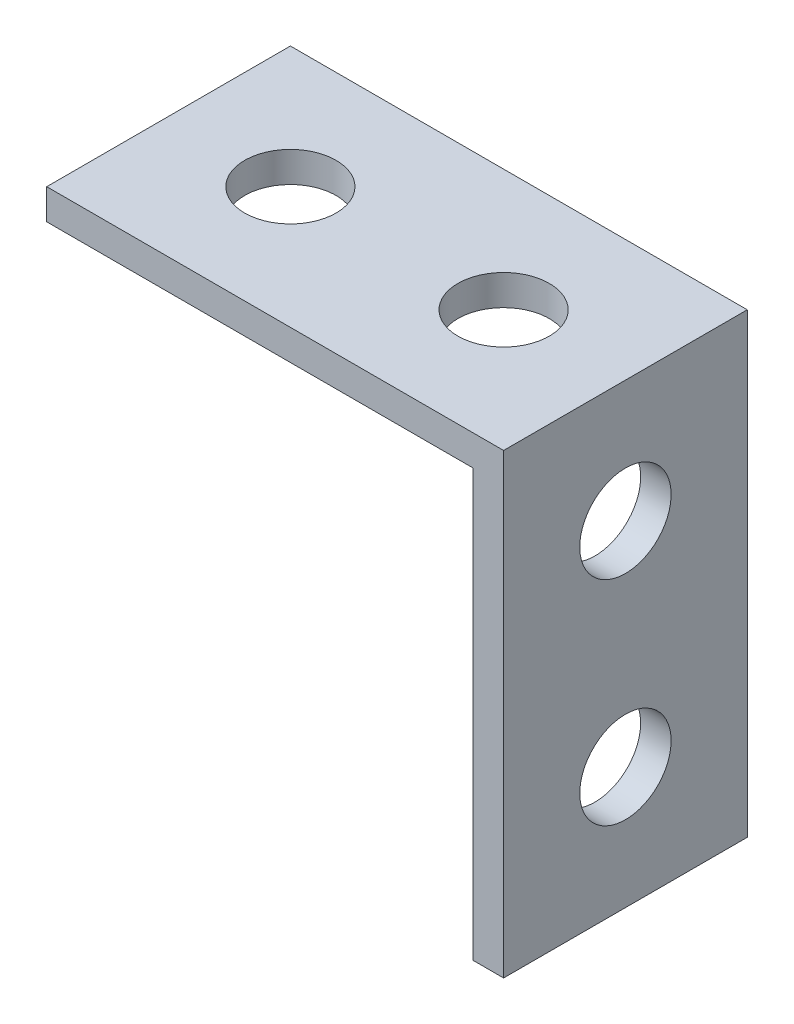
ISO-10303-21;
HEADER;
FILE_DESCRIPTION(('STEP AP214'),'2;1');
FILE_NAME('part.step','',(''),(''),'','','');
FILE_SCHEMA(('AUTOMOTIVE_DESIGN { 1 0 10303 214 1 1 1 1 }'));
ENDSEC;
DATA;
#1=APPLICATION_CONTEXT('core data for automotive mechanical design processes');
#2=APPLICATION_PROTOCOL_DEFINITION('international standard','automotive_design',2000,#1);
#3=PRODUCT_CONTEXT('',#1,'mechanical');
#4=PRODUCT('Part','Part','',(#3));
#5=PRODUCT_RELATED_PRODUCT_CATEGORY('part','',(#4));
#6=PRODUCT_DEFINITION_FORMATION('','',#4);
#7=PRODUCT_DEFINITION_CONTEXT('part definition',#1,'design');
#8=PRODUCT_DEFINITION('design','',#6,#7);
#9=PRODUCT_DEFINITION_SHAPE('','',#8);
#10=(LENGTH_UNIT() NAMED_UNIT(*) SI_UNIT(.MILLI.,.METRE.));
#11=(NAMED_UNIT(*) PLANE_ANGLE_UNIT() SI_UNIT($,.RADIAN.));
#12=(NAMED_UNIT(*) SI_UNIT($,.STERADIAN.) SOLID_ANGLE_UNIT());
#13=UNCERTAINTY_MEASURE_WITH_UNIT(LENGTH_MEASURE(1.E-05),#10,'distance_accuracy_value','');
#14=(GEOMETRIC_REPRESENTATION_CONTEXT(3) GLOBAL_UNCERTAINTY_ASSIGNED_CONTEXT((#13)) GLOBAL_UNIT_ASSIGNED_CONTEXT((#10,
#11,#12)) REPRESENTATION_CONTEXT('',''));
#15=CARTESIAN_POINT('',(0.,0.,0.));
#16=DIRECTION('',(0.,0.,1.));
#17=DIRECTION('',(1.,0.,0.));
#18=AXIS2_PLACEMENT_3D('',#15,#16,#17);
#19=CARTESIAN_POINT('',(7.5,0.,8.));
#20=DIRECTION('',(1.,0.,0.));
#21=DIRECTION('',(0.,1.,0.));
#22=AXIS2_PLACEMENT_3D('',#19,#20,#21);
#23=PLANE('',#22);
#24=CARTESIAN_POINT('',(7.5,-3.5,4.));
#25=DIRECTION('',(1.,0.,0.));
#26=DIRECTION('',(0.,1.,0.));
#27=AXIS2_PLACEMENT_3D('',#24,#25,#26);
#28=CIRCLE('',#27,1.5);
#29=CARTESIAN_POINT('',(7.5,-2.,4.));
#30=VERTEX_POINT('',#29);
#31=EDGE_CURVE('E169',#30,#30,#28,.T.);
#32=ORIENTED_EDGE('',*,*,#31,.F.);
#33=EDGE_LOOP('',(#32));
#34=FACE_BOUND('',#33,.T.);
#35=CARTESIAN_POINT('',(7.50000000000001,-10.5,4.));
#36=DIRECTION('',(1.,0.,0.));
#37=DIRECTION('',(0.,1.,0.));
#38=AXIS2_PLACEMENT_3D('',#35,#36,#37);
#39=CIRCLE('',#38,1.5);
#40=CARTESIAN_POINT('',(7.50000000000001,-9.,4.));
#41=VERTEX_POINT('',#40);
#42=EDGE_CURVE('E177',#41,#41,#39,.T.);
#43=ORIENTED_EDGE('',*,*,#42,.F.);
#44=EDGE_LOOP('',(#43));
#45=FACE_BOUND('',#44,.T.);
#46=DIRECTION('',(0.,-1.,0.));
#47=VECTOR('',#46,1.);
#48=CARTESIAN_POINT('',(7.5,0.,0.));
#49=LINE('',#48,#47);
#50=CARTESIAN_POINT('',(7.5,0.5,0.));
#51=VERTEX_POINT('',#50);
#52=CARTESIAN_POINT('',(7.5,-14.5,0.));
#53=VERTEX_POINT('',#52);
#54=EDGE_CURVE('E130',#51,#53,#49,.T.);
#55=ORIENTED_EDGE('',*,*,#54,.F.);
#56=DIRECTION('',(0.,0.,-1.));
#57=VECTOR('',#56,1.);
#58=CARTESIAN_POINT('',(7.5,0.5,8.));
#59=LINE('',#58,#57);
#60=CARTESIAN_POINT('',(7.5,0.5,8.));
#61=VERTEX_POINT('',#60);
#62=EDGE_CURVE('E11',#61,#51,#59,.T.);
#63=ORIENTED_EDGE('',*,*,#62,.F.);
#64=DIRECTION('',(0.,-1.,0.));
#65=VECTOR('',#64,1.);
#66=CARTESIAN_POINT('',(7.5,0.,8.));
#67=LINE('',#66,#65);
#68=CARTESIAN_POINT('',(7.5,-14.5,8.));
#69=VERTEX_POINT('',#68);
#70=EDGE_CURVE('E150',#61,#69,#67,.T.);
#71=ORIENTED_EDGE('',*,*,#70,.T.);
#72=DIRECTION('',(0.,0.,-1.));
#73=VECTOR('',#72,1.);
#74=CARTESIAN_POINT('',(7.5,-14.5,8.));
#75=LINE('',#74,#73);
#76=EDGE_CURVE('E60',#69,#53,#75,.T.);
#77=ORIENTED_EDGE('',*,*,#76,.T.);
#78=EDGE_LOOP('',(#55,#63,#71,#77));
#79=FACE_BOUND('',#78,.T.);
#80=ADVANCED_FACE('F41',(#34,#45,#79),#23,.T.);
#81=CARTESIAN_POINT('',(0.,0.5,8.));
#82=DIRECTION('',(0.,1.,0.));
#83=DIRECTION('',(0.,0.,1.));
#84=AXIS2_PLACEMENT_3D('',#81,#82,#83);
#85=PLANE('',#84);
#86=CARTESIAN_POINT('',(-3.5,0.5,4.));
#87=DIRECTION('',(0.,1.,0.));
#88=DIRECTION('',(0.,0.,1.));
#89=AXIS2_PLACEMENT_3D('',#86,#87,#88);
#90=CIRCLE('',#89,1.5);
#91=CARTESIAN_POINT('',(-3.5,0.5,5.5));
#92=VERTEX_POINT('',#91);
#93=EDGE_CURVE('E163',#92,#92,#90,.T.);
#94=ORIENTED_EDGE('',*,*,#93,.F.);
#95=EDGE_LOOP('',(#94));
#96=FACE_BOUND('',#95,.T.);
#97=CARTESIAN_POINT('',(3.5,0.5,4.));
#98=DIRECTION('',(0.,1.,0.));
#99=DIRECTION('',(0.,0.,1.));
#100=AXIS2_PLACEMENT_3D('',#97,#98,#99);
#101=CIRCLE('',#100,1.5);
#102=CARTESIAN_POINT('',(3.5,0.5,5.5));
#103=VERTEX_POINT('',#102);
#104=EDGE_CURVE('E175',#103,#103,#101,.T.);
#105=ORIENTED_EDGE('',*,*,#104,.F.);
#106=EDGE_LOOP('',(#105));
#107=FACE_BOUND('',#106,.T.);
#108=DIRECTION('',(1.,0.,0.));
#109=VECTOR('',#108,1.);
#110=CARTESIAN_POINT('',(0.,0.5,0.));
#111=LINE('',#110,#109);
#112=CARTESIAN_POINT('',(-7.5,0.5,0.));
#113=VERTEX_POINT('',#112);
#114=EDGE_CURVE('E133',#113,#51,#111,.T.);
#115=ORIENTED_EDGE('',*,*,#114,.F.);
#116=DIRECTION('',(0.,0.,-1.));
#117=VECTOR('',#116,1.);
#118=CARTESIAN_POINT('',(-7.5,0.5,8.));
#119=LINE('',#118,#117);
#120=CARTESIAN_POINT('',(-7.5,0.5,8.));
#121=VERTEX_POINT('',#120);
#122=EDGE_CURVE('E51',#121,#113,#119,.T.);
#123=ORIENTED_EDGE('',*,*,#122,.F.);
#124=DIRECTION('',(1.,0.,0.));
#125=VECTOR('',#124,1.);
#126=CARTESIAN_POINT('',(0.,0.5,8.));
#127=LINE('',#126,#125);
#128=EDGE_CURVE('E193',#121,#61,#127,.T.);
#129=ORIENTED_EDGE('',*,*,#128,.T.);
#130=ORIENTED_EDGE('',*,*,#62,.T.);
#131=EDGE_LOOP('',(#115,#123,#129,#130));
#132=FACE_BOUND('',#131,.T.);
#133=ADVANCED_FACE('F199',(#96,#107,#132),#85,.T.);
#134=CARTESIAN_POINT('',(-7.5,0.,8.));
#135=DIRECTION('',(1.,0.,0.));
#136=DIRECTION('',(0.,1.,0.));
#137=AXIS2_PLACEMENT_3D('',#134,#135,#136);
#138=PLANE('',#137);
#139=DIRECTION('',(0.,-1.,0.));
#140=VECTOR('',#139,1.);
#141=CARTESIAN_POINT('',(-7.5,0.,0.));
#142=LINE('',#141,#140);
#143=CARTESIAN_POINT('',(-7.5,-0.5,0.));
#144=VERTEX_POINT('',#143);
#145=EDGE_CURVE('E138',#113,#144,#142,.T.);
#146=ORIENTED_EDGE('',*,*,#145,.T.);
#147=DIRECTION('',(0.,0.,-1.));
#148=VECTOR('',#147,1.);
#149=CARTESIAN_POINT('',(-7.5,-0.5,8.));
#150=LINE('',#149,#148);
#151=CARTESIAN_POINT('',(-7.5,-0.5,8.));
#152=VERTEX_POINT('',#151);
#153=EDGE_CURVE('E120',#152,#144,#150,.T.);
#154=ORIENTED_EDGE('',*,*,#153,.F.);
#155=DIRECTION('',(0.,-1.,0.));
#156=VECTOR('',#155,1.);
#157=CARTESIAN_POINT('',(-7.5,0.,8.));
#158=LINE('',#157,#156);
#159=EDGE_CURVE('E106',#121,#152,#158,.T.);
#160=ORIENTED_EDGE('',*,*,#159,.F.);
#161=ORIENTED_EDGE('',*,*,#122,.T.);
#162=EDGE_LOOP('',(#146,#154,#160,#161));
#163=FACE_BOUND('',#162,.T.);
#164=ADVANCED_FACE('F205',(#163),#138,.F.);
#165=CARTESIAN_POINT('',(0.,-0.5,8.));
#166=DIRECTION('',(0.,1.,0.));
#167=DIRECTION('',(0.,0.,1.));
#168=AXIS2_PLACEMENT_3D('',#165,#166,#167);
#169=PLANE('',#168);
#170=CARTESIAN_POINT('',(-3.5,-0.5,4.));
#171=DIRECTION('',(0.,1.,0.));
#172=DIRECTION('',(0.,0.,1.));
#173=AXIS2_PLACEMENT_3D('',#170,#171,#172);
#174=CIRCLE('',#173,1.5);
#175=CARTESIAN_POINT('',(-3.5,-0.5,5.5));
#176=VERTEX_POINT('',#175);
#177=EDGE_CURVE('E134',#176,#176,#174,.T.);
#178=ORIENTED_EDGE('',*,*,#177,.T.);
#179=EDGE_LOOP('',(#178));
#180=FACE_BOUND('',#179,.T.);
#181=CARTESIAN_POINT('',(3.5,-0.5,4.));
#182=DIRECTION('',(0.,1.,0.));
#183=DIRECTION('',(0.,0.,1.));
#184=AXIS2_PLACEMENT_3D('',#181,#182,#183);
#185=CIRCLE('',#184,1.5);
#186=CARTESIAN_POINT('',(3.5,-0.5,5.5));
#187=VERTEX_POINT('',#186);
#188=EDGE_CURVE('E159',#187,#187,#185,.T.);
#189=ORIENTED_EDGE('',*,*,#188,.T.);
#190=EDGE_LOOP('',(#189));
#191=FACE_BOUND('',#190,.T.);
#192=DIRECTION('',(1.,0.,0.));
#193=VECTOR('',#192,1.);
#194=CARTESIAN_POINT('',(0.,-0.5,0.));
#195=LINE('',#194,#193);
#196=CARTESIAN_POINT('',(6.5,-0.5,0.));
#197=VERTEX_POINT('',#196);
#198=EDGE_CURVE('E116',#144,#197,#195,.T.);
#199=ORIENTED_EDGE('',*,*,#198,.T.);
#200=DIRECTION('',(0.,0.,-1.));
#201=VECTOR('',#200,1.);
#202=CARTESIAN_POINT('',(6.5,-0.5,8.));
#203=LINE('',#202,#201);
#204=CARTESIAN_POINT('',(6.5,-0.5,8.));
#205=VERTEX_POINT('',#204);
#206=EDGE_CURVE('E113',#205,#197,#203,.T.);
#207=ORIENTED_EDGE('',*,*,#206,.F.);
#208=DIRECTION('',(1.,0.,0.));
#209=VECTOR('',#208,1.);
#210=CARTESIAN_POINT('',(0.,-0.5,8.));
#211=LINE('',#210,#209);
#212=EDGE_CURVE('E98',#152,#205,#211,.T.);
#213=ORIENTED_EDGE('',*,*,#212,.F.);
#214=ORIENTED_EDGE('',*,*,#153,.T.);
#215=EDGE_LOOP('',(#199,#207,#213,#214));
#216=FACE_BOUND('',#215,.T.);
#217=ADVANCED_FACE('F114',(#180,#191,#216),#169,.F.);
#218=CARTESIAN_POINT('',(6.5,0.,8.));
#219=DIRECTION('',(1.,0.,0.));
#220=DIRECTION('',(0.,1.,0.));
#221=AXIS2_PLACEMENT_3D('',#218,#219,#220);
#222=PLANE('',#221);
#223=CARTESIAN_POINT('',(6.5,-3.5,4.));
#224=DIRECTION('',(1.,0.,0.));
#225=DIRECTION('',(0.,1.,0.));
#226=AXIS2_PLACEMENT_3D('',#223,#224,#225);
#227=CIRCLE('',#226,1.5);
#228=CARTESIAN_POINT('',(6.5,-2.,4.));
#229=VERTEX_POINT('',#228);
#230=EDGE_CURVE('E44',#229,#229,#227,.T.);
#231=ORIENTED_EDGE('',*,*,#230,.T.);
#232=EDGE_LOOP('',(#231));
#233=FACE_BOUND('',#232,.T.);
#234=CARTESIAN_POINT('',(6.49999999999999,-10.5,4.));
#235=DIRECTION('',(1.,0.,0.));
#236=DIRECTION('',(0.,1.,0.));
#237=AXIS2_PLACEMENT_3D('',#234,#235,#236);
#238=CIRCLE('',#237,1.5);
#239=CARTESIAN_POINT('',(6.49999999999999,-9.,4.));
#240=VERTEX_POINT('',#239);
#241=EDGE_CURVE('E166',#240,#240,#238,.T.);
#242=ORIENTED_EDGE('',*,*,#241,.T.);
#243=EDGE_LOOP('',(#242));
#244=FACE_BOUND('',#243,.T.);
#245=DIRECTION('',(0.,-1.,0.));
#246=VECTOR('',#245,1.);
#247=CARTESIAN_POINT('',(6.5,0.,0.));
#248=LINE('',#247,#246);
#249=CARTESIAN_POINT('',(6.5,-14.5,0.));
#250=VERTEX_POINT('',#249);
#251=EDGE_CURVE('E143',#197,#250,#248,.T.);
#252=ORIENTED_EDGE('',*,*,#251,.T.);
#253=DIRECTION('',(0.,0.,-1.));
#254=VECTOR('',#253,1.);
#255=CARTESIAN_POINT('',(6.5,-14.5,8.));
#256=LINE('',#255,#254);
#257=CARTESIAN_POINT('',(6.5,-14.5,8.));
#258=VERTEX_POINT('',#257);
#259=EDGE_CURVE('E80',#258,#250,#256,.T.);
#260=ORIENTED_EDGE('',*,*,#259,.F.);
#261=DIRECTION('',(0.,-1.,0.));
#262=VECTOR('',#261,1.);
#263=CARTESIAN_POINT('',(6.5,0.,8.));
#264=LINE('',#263,#262);
#265=EDGE_CURVE('E103',#205,#258,#264,.T.);
#266=ORIENTED_EDGE('',*,*,#265,.F.);
#267=ORIENTED_EDGE('',*,*,#206,.T.);
#268=EDGE_LOOP('',(#252,#260,#266,#267));
#269=FACE_BOUND('',#268,.T.);
#270=ADVANCED_FACE('F122',(#233,#244,#269),#222,.F.);
#271=CARTESIAN_POINT('',(0.,-14.5,8.));
#272=DIRECTION('',(0.,-1.,0.));
#273=DIRECTION('',(0.,0.,-1.));
#274=AXIS2_PLACEMENT_3D('',#271,#272,#273);
#275=PLANE('',#274);
#276=DIRECTION('',(-1.,0.,0.));
#277=VECTOR('',#276,1.);
#278=CARTESIAN_POINT('',(0.,-14.5,0.));
#279=LINE('',#278,#277);
#280=EDGE_CURVE('E146',#53,#250,#279,.T.);
#281=ORIENTED_EDGE('',*,*,#280,.F.);
#282=ORIENTED_EDGE('',*,*,#76,.F.);
#283=DIRECTION('',(-1.,0.,0.));
#284=VECTOR('',#283,1.);
#285=CARTESIAN_POINT('',(0.,-14.5,8.));
#286=LINE('',#285,#284);
#287=EDGE_CURVE('E124',#69,#258,#286,.T.);
#288=ORIENTED_EDGE('',*,*,#287,.T.);
#289=ORIENTED_EDGE('',*,*,#259,.T.);
#290=EDGE_LOOP('',(#281,#282,#288,#289));
#291=FACE_BOUND('',#290,.T.);
#292=ADVANCED_FACE('F231',(#291),#275,.T.);
#293=CARTESIAN_POINT('',(0.,0.,8.));
#294=DIRECTION('',(0.,0.,1.));
#295=DIRECTION('',(1.,0.,0.));
#296=AXIS2_PLACEMENT_3D('',#293,#294,#295);
#297=PLANE('',#296);
#298=ORIENTED_EDGE('',*,*,#70,.F.);
#299=ORIENTED_EDGE('',*,*,#128,.F.);
#300=ORIENTED_EDGE('',*,*,#159,.T.);
#301=ORIENTED_EDGE('',*,*,#212,.T.);
#302=ORIENTED_EDGE('',*,*,#265,.T.);
#303=ORIENTED_EDGE('',*,*,#287,.F.);
#304=EDGE_LOOP('',(#298,#299,#300,#301,#302,#303));
#305=FACE_BOUND('',#304,.T.);
#306=ADVANCED_FACE('F100',(#305),#297,.T.);
#307=CARTESIAN_POINT('',(0.,0.,0.));
#308=DIRECTION('',(0.,0.,1.));
#309=DIRECTION('',(1.,0.,0.));
#310=AXIS2_PLACEMENT_3D('',#307,#308,#309);
#311=PLANE('',#310);
#312=ORIENTED_EDGE('',*,*,#54,.T.);
#313=ORIENTED_EDGE('',*,*,#280,.T.);
#314=ORIENTED_EDGE('',*,*,#251,.F.);
#315=ORIENTED_EDGE('',*,*,#198,.F.);
#316=ORIENTED_EDGE('',*,*,#145,.F.);
#317=ORIENTED_EDGE('',*,*,#114,.T.);
#318=EDGE_LOOP('',(#312,#313,#314,#315,#316,#317));
#319=FACE_BOUND('',#318,.T.);
#320=ADVANCED_FACE('F227',(#319),#311,.F.);
#321=CARTESIAN_POINT('',(3.5,-14.5,4.));
#322=DIRECTION('',(0.,1.,0.));
#323=DIRECTION('',(0.,0.,1.));
#324=AXIS2_PLACEMENT_3D('',#321,#322,#323);
#325=CYLINDRICAL_SURFACE('',#324,1.5);
#326=ORIENTED_EDGE('',*,*,#104,.T.);
#327=EDGE_LOOP('',(#326));
#328=FACE_BOUND('',#327,.T.);
#329=ORIENTED_EDGE('',*,*,#188,.F.);
#330=EDGE_LOOP('',(#329));
#331=FACE_BOUND('',#330,.T.);
#332=ADVANCED_FACE('F221',(#328,#331),#325,.F.);
#333=CARTESIAN_POINT('',(-3.5,-14.5,4.));
#334=DIRECTION('',(0.,1.,0.));
#335=DIRECTION('',(0.,0.,1.));
#336=AXIS2_PLACEMENT_3D('',#333,#334,#335);
#337=CYLINDRICAL_SURFACE('',#336,1.5);
#338=ORIENTED_EDGE('',*,*,#93,.T.);
#339=EDGE_LOOP('',(#338));
#340=FACE_BOUND('',#339,.T.);
#341=ORIENTED_EDGE('',*,*,#177,.F.);
#342=EDGE_LOOP('',(#341));
#343=FACE_BOUND('',#342,.T.);
#344=ADVANCED_FACE('F214',(#340,#343),#337,.F.);
#345=CARTESIAN_POINT('',(-7.50000000000001,-10.5,4.));
#346=DIRECTION('',(1.,0.,0.));
#347=DIRECTION('',(0.,1.,0.));
#348=AXIS2_PLACEMENT_3D('',#345,#346,#347);
#349=CYLINDRICAL_SURFACE('',#348,1.5);
#350=ORIENTED_EDGE('',*,*,#42,.T.);
#351=EDGE_LOOP('',(#350));
#352=FACE_BOUND('',#351,.T.);
#353=ORIENTED_EDGE('',*,*,#241,.F.);
#354=EDGE_LOOP('',(#353));
#355=FACE_BOUND('',#354,.T.);
#356=ADVANCED_FACE('F210',(#352,#355),#349,.F.);
#357=CARTESIAN_POINT('',(-7.50000000000001,-3.50000000000001,4.));
#358=DIRECTION('',(1.,0.,0.));
#359=DIRECTION('',(0.,1.,0.));
#360=AXIS2_PLACEMENT_3D('',#357,#358,#359);
#361=CYLINDRICAL_SURFACE('',#360,1.5);
#362=ORIENTED_EDGE('',*,*,#31,.T.);
#363=EDGE_LOOP('',(#362));
#364=FACE_BOUND('',#363,.T.);
#365=ORIENTED_EDGE('',*,*,#230,.F.);
#366=EDGE_LOOP('',(#365));
#367=FACE_BOUND('',#366,.T.);
#368=ADVANCED_FACE('F213',(#364,#367),#361,.F.);
#369=CLOSED_SHELL('',(#80,#133,#164,#217,#270,#292,#306,#320,#332,#344,#356,#368));
#370=MANIFOLD_SOLID_BREP('B2',#369);
#371=ADVANCED_BREP_SHAPE_REPRESENTATION('',(#18,#370),#14);
#372=SHAPE_DEFINITION_REPRESENTATION(#9,#371);
ENDSEC;
END-ISO-10303-21;
